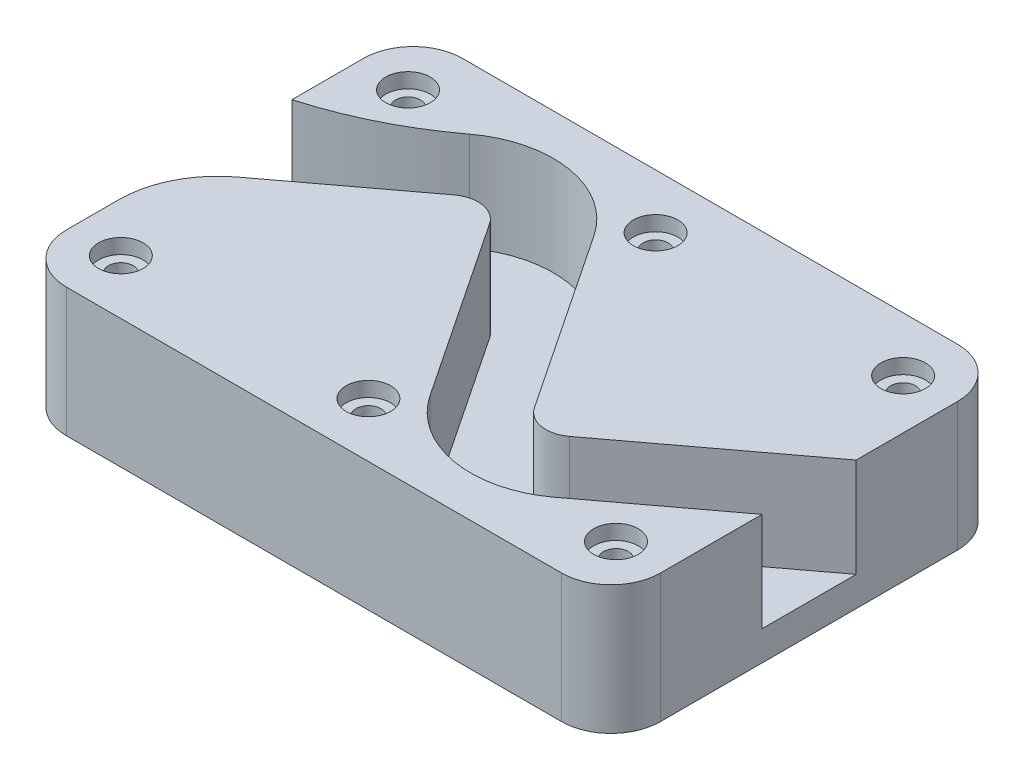
ISO-10303-21;
HEADER;
FILE_DESCRIPTION(('STEP AP214'),'2;1');
FILE_NAME('part.step','',(''),(''),'','','');
FILE_SCHEMA(('AUTOMOTIVE_DESIGN { 1 0 10303 214 1 1 1 1 }'));
ENDSEC;
DATA;
#1=APPLICATION_CONTEXT('core data for automotive mechanical design processes');
#2=APPLICATION_PROTOCOL_DEFINITION('international standard','automotive_design',2000,#1);
#3=PRODUCT_CONTEXT('',#1,'mechanical');
#4=PRODUCT('Part','Part','',(#3));
#5=PRODUCT_RELATED_PRODUCT_CATEGORY('part','',(#4));
#6=PRODUCT_DEFINITION_FORMATION('','',#4);
#7=PRODUCT_DEFINITION_CONTEXT('part definition',#1,'design');
#8=PRODUCT_DEFINITION('design','',#6,#7);
#9=PRODUCT_DEFINITION_SHAPE('','',#8);
#10=(LENGTH_UNIT() NAMED_UNIT(*) SI_UNIT(.MILLI.,.METRE.));
#11=(NAMED_UNIT(*) PLANE_ANGLE_UNIT() SI_UNIT($,.RADIAN.));
#12=(NAMED_UNIT(*) SI_UNIT($,.STERADIAN.) SOLID_ANGLE_UNIT());
#13=UNCERTAINTY_MEASURE_WITH_UNIT(LENGTH_MEASURE(1.E-05),#10,'distance_accuracy_value','');
#14=(GEOMETRIC_REPRESENTATION_CONTEXT(3) GLOBAL_UNCERTAINTY_ASSIGNED_CONTEXT((#13)) GLOBAL_UNIT_ASSIGNED_CONTEXT((#10,
#11,#12)) REPRESENTATION_CONTEXT('',''));
#15=CARTESIAN_POINT('',(0.,0.,0.));
#16=DIRECTION('',(0.,0.,1.));
#17=DIRECTION('',(1.,0.,0.));
#18=AXIS2_PLACEMENT_3D('',#15,#16,#17);
#19=CARTESIAN_POINT('',(-63.5,0.,36.83));
#20=DIRECTION('',(0.,1.,0.));
#21=DIRECTION('',(0.,0.,1.));
#22=AXIS2_PLACEMENT_3D('',#19,#20,#21);
#23=CYLINDRICAL_SURFACE('',#22,3.175);
#24=CARTESIAN_POINT('',(-63.5,0.,36.83));
#25=DIRECTION('',(0.,1.,0.));
#26=DIRECTION('',(0.,0.,1.));
#27=AXIS2_PLACEMENT_3D('',#24,#25,#26);
#28=CIRCLE('',#27,3.175);
#29=CARTESIAN_POINT('',(-63.5,0.,40.005));
#30=VERTEX_POINT('',#29);
#31=EDGE_CURVE('E182',#30,#30,#28,.T.);
#32=ORIENTED_EDGE('',*,*,#31,.F.);
#33=EDGE_LOOP('',(#32));
#34=FACE_BOUND('',#33,.T.);
#35=CARTESIAN_POINT('',(-63.5,29.21,36.83));
#36=DIRECTION('',(0.,1.,0.));
#37=DIRECTION('',(0.,0.,1.));
#38=AXIS2_PLACEMENT_3D('',#35,#36,#37);
#39=CIRCLE('',#38,3.175);
#40=CARTESIAN_POINT('',(-63.5,29.21,40.005));
#41=VERTEX_POINT('',#40);
#42=EDGE_CURVE('E39',#41,#41,#39,.F.);
#43=ORIENTED_EDGE('',*,*,#42,.F.);
#44=EDGE_LOOP('',(#43));
#45=FACE_BOUND('',#44,.T.);
#46=ADVANCED_FACE('F35',(#34,#45),#23,.F.);
#47=CARTESIAN_POINT('',(3.33066907387547E-13,0.,36.83));
#48=DIRECTION('',(0.,1.,0.));
#49=DIRECTION('',(0.,0.,1.));
#50=AXIS2_PLACEMENT_3D('',#47,#48,#49);
#51=CYLINDRICAL_SURFACE('',#50,3.175);
#52=CARTESIAN_POINT('',(3.33066907387547E-13,0.,36.83));
#53=DIRECTION('',(0.,1.,0.));
#54=DIRECTION('',(0.,0.,1.));
#55=AXIS2_PLACEMENT_3D('',#52,#53,#54);
#56=CIRCLE('',#55,3.175);
#57=CARTESIAN_POINT('',(3.33066907387547E-13,0.,40.005));
#58=VERTEX_POINT('',#57);
#59=EDGE_CURVE('E233',#58,#58,#56,.T.);
#60=ORIENTED_EDGE('',*,*,#59,.F.);
#61=EDGE_LOOP('',(#60));
#62=FACE_BOUND('',#61,.T.);
#63=CARTESIAN_POINT('',(3.33066907387547E-13,29.21,36.83));
#64=DIRECTION('',(0.,1.,0.));
#65=DIRECTION('',(0.,0.,1.));
#66=AXIS2_PLACEMENT_3D('',#63,#64,#65);
#67=CIRCLE('',#66,3.175);
#68=CARTESIAN_POINT('',(3.33066907387547E-13,29.21,40.005));
#69=VERTEX_POINT('',#68);
#70=EDGE_CURVE('E198',#69,#69,#67,.F.);
#71=ORIENTED_EDGE('',*,*,#70,.F.);
#72=EDGE_LOOP('',(#71));
#73=FACE_BOUND('',#72,.T.);
#74=ADVANCED_FACE('F496',(#62,#73),#51,.F.);
#75=CARTESIAN_POINT('',(63.5,0.,36.83));
#76=DIRECTION('',(0.,1.,0.));
#77=DIRECTION('',(0.,0.,1.));
#78=AXIS2_PLACEMENT_3D('',#75,#76,#77);
#79=CYLINDRICAL_SURFACE('',#78,3.175);
#80=CARTESIAN_POINT('',(63.5,0.,36.83));
#81=DIRECTION('',(0.,1.,0.));
#82=DIRECTION('',(0.,0.,1.));
#83=AXIS2_PLACEMENT_3D('',#80,#81,#82);
#84=CIRCLE('',#83,3.175);
#85=CARTESIAN_POINT('',(63.5,0.,40.005));
#86=VERTEX_POINT('',#85);
#87=EDGE_CURVE('E236',#86,#86,#84,.T.);
#88=ORIENTED_EDGE('',*,*,#87,.F.);
#89=EDGE_LOOP('',(#88));
#90=FACE_BOUND('',#89,.T.);
#91=CARTESIAN_POINT('',(63.5,29.21,36.83));
#92=DIRECTION('',(0.,1.,0.));
#93=DIRECTION('',(0.,0.,1.));
#94=AXIS2_PLACEMENT_3D('',#91,#92,#93);
#95=CIRCLE('',#94,3.175);
#96=CARTESIAN_POINT('',(63.5,29.21,40.005));
#97=VERTEX_POINT('',#96);
#98=EDGE_CURVE('E194',#97,#97,#95,.F.);
#99=ORIENTED_EDGE('',*,*,#98,.F.);
#100=EDGE_LOOP('',(#99));
#101=FACE_BOUND('',#100,.T.);
#102=ADVANCED_FACE('F502',(#90,#101),#79,.F.);
#103=CARTESIAN_POINT('',(63.5,0.,-36.83));
#104=DIRECTION('',(0.,1.,0.));
#105=DIRECTION('',(0.,0.,1.));
#106=AXIS2_PLACEMENT_3D('',#103,#104,#105);
#107=CYLINDRICAL_SURFACE('',#106,3.175);
#108=CARTESIAN_POINT('',(63.5,0.,-36.83));
#109=DIRECTION('',(0.,1.,0.));
#110=DIRECTION('',(0.,0.,1.));
#111=AXIS2_PLACEMENT_3D('',#108,#109,#110);
#112=CIRCLE('',#111,3.175);
#113=CARTESIAN_POINT('',(63.5,0.,-33.655));
#114=VERTEX_POINT('',#113);
#115=EDGE_CURVE('E245',#114,#114,#112,.T.);
#116=ORIENTED_EDGE('',*,*,#115,.F.);
#117=EDGE_LOOP('',(#116));
#118=FACE_BOUND('',#117,.T.);
#119=CARTESIAN_POINT('',(63.5,29.21,-36.83));
#120=DIRECTION('',(0.,1.,0.));
#121=DIRECTION('',(0.,0.,1.));
#122=AXIS2_PLACEMENT_3D('',#119,#120,#121);
#123=CIRCLE('',#122,3.175);
#124=CARTESIAN_POINT('',(63.5,29.21,-33.655));
#125=VERTEX_POINT('',#124);
#126=EDGE_CURVE('E189',#125,#125,#123,.F.);
#127=ORIENTED_EDGE('',*,*,#126,.F.);
#128=EDGE_LOOP('',(#127));
#129=FACE_BOUND('',#128,.T.);
#130=ADVANCED_FACE('F513',(#118,#129),#107,.F.);
#131=CARTESIAN_POINT('',(0.,0.,-36.83));
#132=DIRECTION('',(0.,1.,0.));
#133=DIRECTION('',(0.,0.,1.));
#134=AXIS2_PLACEMENT_3D('',#131,#132,#133);
#135=CYLINDRICAL_SURFACE('',#134,3.175);
#136=CARTESIAN_POINT('',(0.,0.,-36.83));
#137=DIRECTION('',(0.,1.,0.));
#138=DIRECTION('',(0.,0.,1.));
#139=AXIS2_PLACEMENT_3D('',#136,#137,#138);
#140=CIRCLE('',#139,3.175);
#141=CARTESIAN_POINT('',(0.,0.,-33.655));
#142=VERTEX_POINT('',#141);
#143=EDGE_CURVE('E242',#142,#142,#140,.T.);
#144=ORIENTED_EDGE('',*,*,#143,.F.);
#145=EDGE_LOOP('',(#144));
#146=FACE_BOUND('',#145,.T.);
#147=CARTESIAN_POINT('',(0.,29.21,-36.83));
#148=DIRECTION('',(0.,1.,0.));
#149=DIRECTION('',(0.,0.,1.));
#150=AXIS2_PLACEMENT_3D('',#147,#148,#149);
#151=CIRCLE('',#150,3.175);
#152=CARTESIAN_POINT('',(0.,29.21,-33.655));
#153=VERTEX_POINT('',#152);
#154=EDGE_CURVE('E184',#153,#153,#151,.F.);
#155=ORIENTED_EDGE('',*,*,#154,.F.);
#156=EDGE_LOOP('',(#155));
#157=FACE_BOUND('',#156,.T.);
#158=ADVANCED_FACE('F518',(#146,#157),#135,.F.);
#159=CARTESIAN_POINT('',(-63.5,0.,-36.83));
#160=DIRECTION('',(0.,1.,0.));
#161=DIRECTION('',(0.,0.,1.));
#162=AXIS2_PLACEMENT_3D('',#159,#160,#161);
#163=CYLINDRICAL_SURFACE('',#162,3.175);
#164=CARTESIAN_POINT('',(-63.5,0.,-36.83));
#165=DIRECTION('',(0.,1.,0.));
#166=DIRECTION('',(0.,0.,1.));
#167=AXIS2_PLACEMENT_3D('',#164,#165,#166);
#168=CIRCLE('',#167,3.175);
#169=CARTESIAN_POINT('',(-63.5,0.,-33.655));
#170=VERTEX_POINT('',#169);
#171=EDGE_CURVE('E239',#170,#170,#168,.T.);
#172=ORIENTED_EDGE('',*,*,#171,.F.);
#173=EDGE_LOOP('',(#172));
#174=FACE_BOUND('',#173,.T.);
#175=CARTESIAN_POINT('',(-63.5,29.21,-36.83));
#176=DIRECTION('',(0.,1.,0.));
#177=DIRECTION('',(0.,0.,1.));
#178=AXIS2_PLACEMENT_3D('',#175,#176,#177);
#179=CIRCLE('',#178,3.175);
#180=CARTESIAN_POINT('',(-63.5,29.21,-33.655));
#181=VERTEX_POINT('',#180);
#182=EDGE_CURVE('E179',#181,#181,#179,.F.);
#183=ORIENTED_EDGE('',*,*,#182,.F.);
#184=EDGE_LOOP('',(#183));
#185=FACE_BOUND('',#184,.T.);
#186=ADVANCED_FACE('F515',(#174,#185),#163,.F.);
#187=CARTESIAN_POINT('',(-63.5,33.02,-38.1));
#188=DIRECTION('',(0.,1.,0.));
#189=DIRECTION('',(0.,0.,1.));
#190=AXIS2_PLACEMENT_3D('',#187,#188,#189);
#191=PLANE('',#190);
#192=CARTESIAN_POINT('',(-63.5,33.02,36.83));
#193=DIRECTION('',(0.,1.,0.));
#194=DIRECTION('',(0.,0.,1.));
#195=AXIS2_PLACEMENT_3D('',#192,#193,#194);
#196=CIRCLE('',#195,5.715);
#197=CARTESIAN_POINT('',(-63.5,33.02,42.545));
#198=VERTEX_POINT('',#197);
#199=EDGE_CURVE('E214',#198,#198,#196,.T.);
#200=ORIENTED_EDGE('',*,*,#199,.F.);
#201=EDGE_LOOP('',(#200));
#202=FACE_BOUND('',#201,.T.);
#203=CARTESIAN_POINT('',(3.33066907387547E-13,33.02,36.83));
#204=DIRECTION('',(0.,1.,0.));
#205=DIRECTION('',(0.,0.,1.));
#206=AXIS2_PLACEMENT_3D('',#203,#204,#205);
#207=CIRCLE('',#206,5.715);
#208=CARTESIAN_POINT('',(3.33066907387547E-13,33.02,42.545));
#209=VERTEX_POINT('',#208);
#210=EDGE_CURVE('E207',#209,#209,#207,.T.);
#211=ORIENTED_EDGE('',*,*,#210,.F.);
#212=EDGE_LOOP('',(#211));
#213=FACE_BOUND('',#212,.T.);
#214=CARTESIAN_POINT('',(63.5,33.02,36.83));
#215=DIRECTION('',(0.,1.,0.));
#216=DIRECTION('',(0.,0.,1.));
#217=AXIS2_PLACEMENT_3D('',#214,#215,#216);
#218=CIRCLE('',#217,5.71499999999999);
#219=CARTESIAN_POINT('',(63.5,33.02,42.545));
#220=VERTEX_POINT('',#219);
#221=EDGE_CURVE('E200',#220,#220,#218,.T.);
#222=ORIENTED_EDGE('',*,*,#221,.F.);
#223=EDGE_LOOP('',(#222));
#224=FACE_BOUND('',#223,.T.);
#225=DIRECTION('',(0.8,0.,-0.6));
#226=VECTOR('',#225,1.);
#227=CARTESIAN_POINT('',(45.7977514732922,33.02,34.8666863950309));
#228=LINE('',#227,#226);
#229=CARTESIAN_POINT('',(45.7977514732922,33.02,34.8666863950309));
#230=VERTEX_POINT('',#229);
#231=CARTESIAN_POINT('',(76.2,33.02,12.065));
#232=VERTEX_POINT('',#231);
#233=EDGE_CURVE('E252',#230,#232,#228,.T.);
#234=ORIENTED_EDGE('',*,*,#233,.F.);
#235=CARTESIAN_POINT('',(29.643351473292,33.02,13.327486395031));
#236=DIRECTION('',(0.,1.,0.));
#237=DIRECTION('',(0.,0.,-1.));
#238=AXIS2_PLACEMENT_3D('',#235,#236,#237);
#239=CIRCLE('',#238,26.924);
#240=CARTESIAN_POINT('',(7.24122934853979,33.02,28.2622344781989));
#241=VERTEX_POINT('',#240);
#242=EDGE_CURVE('E313',#241,#230,#239,.T.);
#243=ORIENTED_EDGE('',*,*,#242,.F.);
#244=DIRECTION('',(0.554700196225229,0.,0.832050294337843));
#245=VECTOR('',#244,1.);
#246=CARTESIAN_POINT('',(-23.3031282304376,33.02,-17.5543018902672));
#247=LINE('',#246,#245);
#248=CARTESIAN_POINT('',(-23.3031282304376,33.02,-17.5543018902672));
#249=VERTEX_POINT('',#248);
#250=EDGE_CURVE('E310',#249,#241,#247,.T.);
#251=ORIENTED_EDGE('',*,*,#250,.F.);
#252=CARTESIAN_POINT('',(-29.643351473292,33.02,-13.327486395031));
#253=DIRECTION('',(0.,-1.,0.));
#254=DIRECTION('',(0.,0.,-1.));
#255=AXIS2_PLACEMENT_3D('',#252,#253,#254);
#256=CIRCLE('',#255,7.62);
#257=CARTESIAN_POINT('',(-34.2153514732921,33.02,-19.423486395031));
#258=VERTEX_POINT('',#257);
#259=EDGE_CURVE('E307',#258,#249,#256,.T.);
#260=ORIENTED_EDGE('',*,*,#259,.F.);
#261=DIRECTION('',(0.8,0.,-0.6));
#262=VECTOR('',#261,1.);
#263=CARTESIAN_POINT('',(-66.04,33.02,4.44500000000001));
#264=LINE('',#263,#262);
#265=CARTESIAN_POINT('',(-66.04,33.02,4.44500000000001));
#266=VERTEX_POINT('',#265);
#267=EDGE_CURVE('E304',#266,#258,#264,.T.);
#268=ORIENTED_EDGE('',*,*,#267,.F.);
#269=CARTESIAN_POINT('',(-50.8,33.02,24.765));
#270=DIRECTION('',(0.,-1.,0.));
#271=DIRECTION('',(0.,0.,-1.));
#272=AXIS2_PLACEMENT_3D('',#269,#270,#271);
#273=CIRCLE('',#272,25.4);
#274=CARTESIAN_POINT('',(-76.2,33.02,24.765));
#275=VERTEX_POINT('',#274);
#276=EDGE_CURVE('E301',#275,#266,#273,.T.);
#277=ORIENTED_EDGE('',*,*,#276,.F.);
#278=DIRECTION('',(0.,0.,1.));
#279=VECTOR('',#278,1.);
#280=CARTESIAN_POINT('',(-76.2,33.02,38.0999999999999));
#281=LINE('',#280,#279);
#282=CARTESIAN_POINT('',(-76.2,33.02,38.0999999999999));
#283=VERTEX_POINT('',#282);
#284=EDGE_CURVE('E354',#275,#283,#281,.T.);
#285=ORIENTED_EDGE('',*,*,#284,.T.);
#286=CARTESIAN_POINT('',(-63.5,33.02,38.1));
#287=DIRECTION('',(0.,1.,0.));
#288=DIRECTION('',(0.,0.,-1.));
#289=AXIS2_PLACEMENT_3D('',#286,#287,#288);
#290=CIRCLE('',#289,12.7);
#291=CARTESIAN_POINT('',(-63.4999999999999,33.02,50.8));
#292=VERTEX_POINT('',#291);
#293=EDGE_CURVE('E356',#283,#292,#290,.T.);
#294=ORIENTED_EDGE('',*,*,#293,.T.);
#295=DIRECTION('',(1.,0.,0.));
#296=VECTOR('',#295,1.);
#297=CARTESIAN_POINT('',(-63.4999999999999,33.02,50.8));
#298=LINE('',#297,#296);
#299=CARTESIAN_POINT('',(63.4999999999999,33.02,50.8));
#300=VERTEX_POINT('',#299);
#301=EDGE_CURVE('E358',#292,#300,#298,.T.);
#302=ORIENTED_EDGE('',*,*,#301,.T.);
#303=CARTESIAN_POINT('',(63.5,33.02,38.1));
#304=DIRECTION('',(0.,1.,0.));
#305=DIRECTION('',(0.,0.,-1.));
#306=AXIS2_PLACEMENT_3D('',#303,#304,#305);
#307=CIRCLE('',#306,12.7);
#308=CARTESIAN_POINT('',(76.2,33.02,38.0999999999999));
#309=VERTEX_POINT('',#308);
#310=EDGE_CURVE('E130',#300,#309,#307,.T.);
#311=ORIENTED_EDGE('',*,*,#310,.T.);
#312=DIRECTION('',(0.,0.,-1.));
#313=VECTOR('',#312,1.);
#314=CARTESIAN_POINT('',(76.2,33.02,38.0999999999999));
#315=LINE('',#314,#313);
#316=EDGE_CURVE('E129',#309,#232,#315,.T.);
#317=ORIENTED_EDGE('',*,*,#316,.T.);
#318=EDGE_LOOP('',(#234,#243,#251,#260,#268,#277,#285,#294,#302,#311,#317));
#319=FACE_BOUND('',#318,.T.);
#320=ADVANCED_FACE('F363',(#202,#213,#224,#319),#191,.T.);
#321=CARTESIAN_POINT('',(-63.5,33.02,-38.1));
#322=DIRECTION('',(0.,-1.,0.));
#323=DIRECTION('',(0.,0.,-1.));
#324=AXIS2_PLACEMENT_3D('',#321,#322,#323);
#325=CYLINDRICAL_SURFACE('',#324,12.7);
#326=CARTESIAN_POINT('',(-63.5,0.,-38.1));
#327=DIRECTION('',(0.,1.,0.));
#328=DIRECTION('',(0.,0.,1.));
#329=AXIS2_PLACEMENT_3D('',#326,#327,#328);
#330=CIRCLE('',#329,12.7);
#331=CARTESIAN_POINT('',(-63.4999999999999,0.,-50.8));
#332=VERTEX_POINT('',#331);
#333=CARTESIAN_POINT('',(-76.2,0.,-38.0999999999999));
#334=VERTEX_POINT('',#333);
#335=EDGE_CURVE('E151',#332,#334,#330,.T.);
#336=ORIENTED_EDGE('',*,*,#335,.T.);
#337=DIRECTION('',(0.,-1.,0.));
#338=VECTOR('',#337,1.);
#339=CARTESIAN_POINT('',(-76.2,33.02,-38.0999999999999));
#340=LINE('',#339,#338);
#341=CARTESIAN_POINT('',(-76.2,33.02,-38.0999999999999));
#342=VERTEX_POINT('',#341);
#343=EDGE_CURVE('E11',#342,#334,#340,.T.);
#344=ORIENTED_EDGE('',*,*,#343,.F.);
#345=CARTESIAN_POINT('',(-63.5,33.02,-38.1));
#346=DIRECTION('',(0.,1.,0.));
#347=DIRECTION('',(0.,0.,1.));
#348=AXIS2_PLACEMENT_3D('',#345,#346,#347);
#349=CIRCLE('',#348,12.7);
#350=CARTESIAN_POINT('',(-63.4999999999999,33.02,-50.8));
#351=VERTEX_POINT('',#350);
#352=EDGE_CURVE('E167',#351,#342,#349,.T.);
#353=ORIENTED_EDGE('',*,*,#352,.F.);
#354=DIRECTION('',(0.,-1.,0.));
#355=VECTOR('',#354,1.);
#356=CARTESIAN_POINT('',(-63.4999999999999,33.02,-50.8));
#357=LINE('',#356,#355);
#358=EDGE_CURVE('E146',#351,#332,#357,.T.);
#359=ORIENTED_EDGE('',*,*,#358,.T.);
#360=EDGE_LOOP('',(#336,#344,#353,#359));
#361=FACE_BOUND('',#360,.T.);
#362=ADVANCED_FACE('F37',(#361),#325,.T.);
#363=CARTESIAN_POINT('',(-76.2,33.02,38.0999999999999));
#364=DIRECTION('',(1.,0.,0.));
#365=DIRECTION('',(0.,0.,-1.));
#366=AXIS2_PLACEMENT_3D('',#363,#364,#365);
#367=PLANE('',#366);
#368=ORIENTED_EDGE('',*,*,#284,.F.);
#369=DIRECTION('',(0.,1.,0.));
#370=VECTOR('',#369,1.);
#371=CARTESIAN_POINT('',(-76.2,7.62,24.765));
#372=LINE('',#371,#370);
#373=CARTESIAN_POINT('',(-76.2,7.62,24.765));
#374=VERTEX_POINT('',#373);
#375=EDGE_CURVE('E335',#374,#275,#372,.T.);
#376=ORIENTED_EDGE('',*,*,#375,.F.);
#377=DIRECTION('',(0.,0.,1.));
#378=VECTOR('',#377,1.);
#379=CARTESIAN_POINT('',(-76.2,7.62,-19.7593275655722));
#380=LINE('',#379,#378);
#381=CARTESIAN_POINT('',(-76.2,7.62,-19.7593275655722));
#382=VERTEX_POINT('',#381);
#383=EDGE_CURVE('E267',#382,#374,#380,.T.);
#384=ORIENTED_EDGE('',*,*,#383,.F.);
#385=DIRECTION('',(0.,1.,0.));
#386=VECTOR('',#385,1.);
#387=CARTESIAN_POINT('',(-76.2,7.62,-19.7593275655722));
#388=LINE('',#387,#386);
#389=CARTESIAN_POINT('',(-76.2,33.02,-19.7593275655722));
#390=VERTEX_POINT('',#389);
#391=EDGE_CURVE('E338',#382,#390,#388,.T.);
#392=ORIENTED_EDGE('',*,*,#391,.T.);
#393=EDGE_CURVE('E102',#342,#390,#281,.T.);
#394=ORIENTED_EDGE('',*,*,#393,.F.);
#395=ORIENTED_EDGE('',*,*,#343,.T.);
#396=DIRECTION('',(0.,0.,1.));
#397=VECTOR('',#396,1.);
#398=CARTESIAN_POINT('',(-76.2,0.,38.0999999999999));
#399=LINE('',#398,#397);
#400=CARTESIAN_POINT('',(-76.2,0.,38.0999999999999));
#401=VERTEX_POINT('',#400);
#402=EDGE_CURVE('E154',#334,#401,#399,.T.);
#403=ORIENTED_EDGE('',*,*,#402,.T.);
#404=DIRECTION('',(0.,-1.,0.));
#405=VECTOR('',#404,1.);
#406=CARTESIAN_POINT('',(-76.2,33.02,38.0999999999999));
#407=LINE('',#406,#405);
#408=EDGE_CURVE('E44',#283,#401,#407,.T.);
#409=ORIENTED_EDGE('',*,*,#408,.F.);
#410=EDGE_LOOP('',(#368,#376,#384,#392,#394,#395,#403,#409));
#411=FACE_BOUND('',#410,.T.);
#412=ADVANCED_FACE('F433',(#411),#367,.F.);
#413=CARTESIAN_POINT('',(-63.5,33.02,38.1));
#414=DIRECTION('',(0.,-1.,0.));
#415=DIRECTION('',(0.,0.,-1.));
#416=AXIS2_PLACEMENT_3D('',#413,#414,#415);
#417=CYLINDRICAL_SURFACE('',#416,12.7);
#418=CARTESIAN_POINT('',(-63.5,0.,38.1));
#419=DIRECTION('',(0.,1.,0.));
#420=DIRECTION('',(0.,0.,-1.));
#421=AXIS2_PLACEMENT_3D('',#418,#419,#420);
#422=CIRCLE('',#421,12.7);
#423=CARTESIAN_POINT('',(-63.4999999999999,0.,50.8));
#424=VERTEX_POINT('',#423);
#425=EDGE_CURVE('E157',#401,#424,#422,.T.);
#426=ORIENTED_EDGE('',*,*,#425,.T.);
#427=DIRECTION('',(0.,-1.,0.));
#428=VECTOR('',#427,1.);
#429=CARTESIAN_POINT('',(-63.4999999999999,33.02,50.8));
#430=LINE('',#429,#428);
#431=EDGE_CURVE('E174',#292,#424,#430,.T.);
#432=ORIENTED_EDGE('',*,*,#431,.F.);
#433=ORIENTED_EDGE('',*,*,#293,.F.);
#434=ORIENTED_EDGE('',*,*,#408,.T.);
#435=EDGE_LOOP('',(#426,#432,#433,#434));
#436=FACE_BOUND('',#435,.T.);
#437=ADVANCED_FACE('F440',(#436),#417,.T.);
#438=CARTESIAN_POINT('',(-63.4999999999999,33.02,50.8));
#439=DIRECTION('',(0.,0.,-1.));
#440=DIRECTION('',(-1.,0.,0.));
#441=AXIS2_PLACEMENT_3D('',#438,#439,#440);
#442=PLANE('',#441);
#443=DIRECTION('',(1.,0.,0.));
#444=VECTOR('',#443,1.);
#445=CARTESIAN_POINT('',(-63.4999999999999,0.,50.8));
#446=LINE('',#445,#444);
#447=CARTESIAN_POINT('',(63.4999999999999,0.,50.8));
#448=VERTEX_POINT('',#447);
#449=EDGE_CURVE('E159',#424,#448,#446,.T.);
#450=ORIENTED_EDGE('',*,*,#449,.T.);
#451=DIRECTION('',(0.,-1.,0.));
#452=VECTOR('',#451,1.);
#453=CARTESIAN_POINT('',(63.4999999999999,33.02,50.8));
#454=LINE('',#453,#452);
#455=EDGE_CURVE('E171',#300,#448,#454,.T.);
#456=ORIENTED_EDGE('',*,*,#455,.F.);
#457=ORIENTED_EDGE('',*,*,#301,.F.);
#458=ORIENTED_EDGE('',*,*,#431,.T.);
#459=EDGE_LOOP('',(#450,#456,#457,#458));
#460=FACE_BOUND('',#459,.T.);
#461=ADVANCED_FACE('F443',(#460),#442,.F.);
#462=CARTESIAN_POINT('',(63.5,33.02,38.1));
#463=DIRECTION('',(0.,-1.,0.));
#464=DIRECTION('',(0.,0.,-1.));
#465=AXIS2_PLACEMENT_3D('',#462,#463,#464);
#466=CYLINDRICAL_SURFACE('',#465,12.7);
#467=CARTESIAN_POINT('',(63.5,0.,38.1));
#468=DIRECTION('',(0.,1.,0.));
#469=DIRECTION('',(0.,0.,-1.));
#470=AXIS2_PLACEMENT_3D('',#467,#468,#469);
#471=CIRCLE('',#470,12.7);
#472=CARTESIAN_POINT('',(76.2,0.,38.0999999999999));
#473=VERTEX_POINT('',#472);
#474=EDGE_CURVE('E161',#448,#473,#471,.T.);
#475=ORIENTED_EDGE('',*,*,#474,.T.);
#476=DIRECTION('',(0.,-1.,0.));
#477=VECTOR('',#476,1.);
#478=CARTESIAN_POINT('',(76.2,33.02,38.0999999999999));
#479=LINE('',#478,#477);
#480=EDGE_CURVE('E141',#309,#473,#479,.T.);
#481=ORIENTED_EDGE('',*,*,#480,.F.);
#482=ORIENTED_EDGE('',*,*,#310,.F.);
#483=ORIENTED_EDGE('',*,*,#455,.T.);
#484=EDGE_LOOP('',(#475,#481,#482,#483));
#485=FACE_BOUND('',#484,.T.);
#486=ADVANCED_FACE('F368',(#485),#466,.T.);
#487=CARTESIAN_POINT('',(76.2,33.02,38.0999999999999));
#488=DIRECTION('',(-1.,0.,0.));
#489=DIRECTION('',(0.,0.,1.));
#490=AXIS2_PLACEMENT_3D('',#487,#488,#489);
#491=PLANE('',#490);
#492=DIRECTION('',(0.,0.,-1.));
#493=VECTOR('',#492,1.);
#494=CARTESIAN_POINT('',(76.2,7.62,-12.065));
#495=LINE('',#494,#493);
#496=CARTESIAN_POINT('',(76.2,7.62,12.065));
#497=VERTEX_POINT('',#496);
#498=CARTESIAN_POINT('',(76.2,7.62,-12.065));
#499=VERTEX_POINT('',#498);
#500=EDGE_CURVE('E248',#497,#499,#495,.T.);
#501=ORIENTED_EDGE('',*,*,#500,.F.);
#502=DIRECTION('',(0.,1.,0.));
#503=VECTOR('',#502,1.);
#504=CARTESIAN_POINT('',(76.2,7.62,12.065));
#505=LINE('',#504,#503);
#506=EDGE_CURVE('E155',#497,#232,#505,.T.);
#507=ORIENTED_EDGE('',*,*,#506,.T.);
#508=ORIENTED_EDGE('',*,*,#316,.F.);
#509=ORIENTED_EDGE('',*,*,#480,.T.);
#510=DIRECTION('',(0.,0.,-1.));
#511=VECTOR('',#510,1.);
#512=CARTESIAN_POINT('',(76.2,0.,38.0999999999999));
#513=LINE('',#512,#511);
#514=CARTESIAN_POINT('',(76.2,0.,-38.0999999999999));
#515=VERTEX_POINT('',#514);
#516=EDGE_CURVE('E138',#473,#515,#513,.T.);
#517=ORIENTED_EDGE('',*,*,#516,.T.);
#518=DIRECTION('',(0.,-1.,0.));
#519=VECTOR('',#518,1.);
#520=CARTESIAN_POINT('',(76.2,33.02,-38.0999999999999));
#521=LINE('',#520,#519);
#522=CARTESIAN_POINT('',(76.2,33.02,-38.0999999999999));
#523=VERTEX_POINT('',#522);
#524=EDGE_CURVE('E133',#523,#515,#521,.T.);
#525=ORIENTED_EDGE('',*,*,#524,.F.);
#526=CARTESIAN_POINT('',(76.2,33.02,-12.065));
#527=VERTEX_POINT('',#526);
#528=EDGE_CURVE('E119',#527,#523,#315,.T.);
#529=ORIENTED_EDGE('',*,*,#528,.F.);
#530=DIRECTION('',(0.,1.,0.));
#531=VECTOR('',#530,1.);
#532=CARTESIAN_POINT('',(76.2,7.62,-12.065));
#533=LINE('',#532,#531);
#534=EDGE_CURVE('E52',#499,#527,#533,.T.);
#535=ORIENTED_EDGE('',*,*,#534,.F.);
#536=EDGE_LOOP('',(#501,#507,#508,#509,#517,#525,#529,#535));
#537=FACE_BOUND('',#536,.T.);
#538=ADVANCED_FACE('F135',(#537),#491,.F.);
#539=CARTESIAN_POINT('',(63.5,33.02,-38.1));
#540=DIRECTION('',(0.,-1.,0.));
#541=DIRECTION('',(0.,0.,-1.));
#542=AXIS2_PLACEMENT_3D('',#539,#540,#541);
#543=CYLINDRICAL_SURFACE('',#542,12.7);
#544=CARTESIAN_POINT('',(63.5,0.,-38.1));
#545=DIRECTION('',(0.,1.,0.));
#546=DIRECTION('',(0.,0.,1.));
#547=AXIS2_PLACEMENT_3D('',#544,#545,#546);
#548=CIRCLE('',#547,12.7);
#549=CARTESIAN_POINT('',(63.4999999999999,0.,-50.8));
#550=VERTEX_POINT('',#549);
#551=EDGE_CURVE('E164',#515,#550,#548,.T.);
#552=ORIENTED_EDGE('',*,*,#551,.T.);
#553=DIRECTION('',(0.,-1.,0.));
#554=VECTOR('',#553,1.);
#555=CARTESIAN_POINT('',(63.4999999999999,33.02,-50.8));
#556=LINE('',#555,#554);
#557=CARTESIAN_POINT('',(63.4999999999999,33.02,-50.8));
#558=VERTEX_POINT('',#557);
#559=EDGE_CURVE('E142',#558,#550,#556,.T.);
#560=ORIENTED_EDGE('',*,*,#559,.F.);
#561=CARTESIAN_POINT('',(63.5,33.02,-38.1));
#562=DIRECTION('',(0.,1.,0.));
#563=DIRECTION('',(0.,0.,1.));
#564=AXIS2_PLACEMENT_3D('',#561,#562,#563);
#565=CIRCLE('',#564,12.7);
#566=EDGE_CURVE('E124',#523,#558,#565,.T.);
#567=ORIENTED_EDGE('',*,*,#566,.F.);
#568=ORIENTED_EDGE('',*,*,#524,.T.);
#569=EDGE_LOOP('',(#552,#560,#567,#568));
#570=FACE_BOUND('',#569,.T.);
#571=ADVANCED_FACE('F144',(#570),#543,.T.);
#572=CARTESIAN_POINT('',(-63.4999999999999,33.02,-50.8));
#573=DIRECTION('',(0.,0.,1.));
#574=DIRECTION('',(1.,0.,0.));
#575=AXIS2_PLACEMENT_3D('',#572,#573,#574);
#576=PLANE('',#575);
#577=DIRECTION('',(-1.,0.,0.));
#578=VECTOR('',#577,1.);
#579=CARTESIAN_POINT('',(-63.4999999999999,0.,-50.8));
#580=LINE('',#579,#578);
#581=EDGE_CURVE('E94',#550,#332,#580,.T.);
#582=ORIENTED_EDGE('',*,*,#581,.T.);
#583=ORIENTED_EDGE('',*,*,#358,.F.);
#584=DIRECTION('',(-1.,0.,0.));
#585=VECTOR('',#584,1.);
#586=CARTESIAN_POINT('',(-63.4999999999999,33.02,-50.8));
#587=LINE('',#586,#585);
#588=EDGE_CURVE('E61',#558,#351,#587,.T.);
#589=ORIENTED_EDGE('',*,*,#588,.F.);
#590=ORIENTED_EDGE('',*,*,#559,.T.);
#591=EDGE_LOOP('',(#582,#583,#589,#590));
#592=FACE_BOUND('',#591,.T.);
#593=ADVANCED_FACE('F447',(#592),#576,.F.);
#594=CARTESIAN_POINT('',(63.5,33.02,-36.83));
#595=DIRECTION('',(0.,1.,0.));
#596=DIRECTION('',(0.,0.,1.));
#597=AXIS2_PLACEMENT_3D('',#594,#595,#596);
#598=CIRCLE('',#597,5.71499999999999);
#599=CARTESIAN_POINT('',(63.5,33.02,-31.115));
#600=VERTEX_POINT('',#599);
#601=EDGE_CURVE('E196',#600,#600,#598,.T.);
#602=ORIENTED_EDGE('',*,*,#601,.F.);
#603=EDGE_LOOP('',(#602));
#604=FACE_BOUND('',#603,.T.);
#605=CARTESIAN_POINT('',(0.,33.02,-36.83));
#606=DIRECTION('',(0.,1.,0.));
#607=DIRECTION('',(0.,0.,1.));
#608=AXIS2_PLACEMENT_3D('',#605,#606,#607);
#609=CIRCLE('',#608,5.715);
#610=CARTESIAN_POINT('',(0.,33.02,-31.115));
#611=VERTEX_POINT('',#610);
#612=EDGE_CURVE('E192',#611,#611,#609,.T.);
#613=ORIENTED_EDGE('',*,*,#612,.F.);
#614=EDGE_LOOP('',(#613));
#615=FACE_BOUND('',#614,.T.);
#616=CARTESIAN_POINT('',(-63.5,33.02,-36.83));
#617=DIRECTION('',(0.,1.,0.));
#618=DIRECTION('',(0.,0.,1.));
#619=AXIS2_PLACEMENT_3D('',#616,#617,#618);
#620=CIRCLE('',#619,5.715);
#621=CARTESIAN_POINT('',(-63.5,33.02,-31.115));
#622=VERTEX_POINT('',#621);
#623=EDGE_CURVE('E187',#622,#622,#620,.T.);
#624=ORIENTED_EDGE('',*,*,#623,.F.);
#625=EDGE_LOOP('',(#624));
#626=FACE_BOUND('',#625,.T.);
#627=CARTESIAN_POINT('',(-101.968790940015,33.02,-109.761405683995));
#628=DIRECTION('',(0.,-1.,0.));
#629=DIRECTION('',(0.,0.,-1.));
#630=AXIS2_PLACEMENT_3D('',#627,#628,#629);
#631=CIRCLE('',#630,93.6183991112056);
#632=CARTESIAN_POINT('',(-45.7977514732922,33.02,-34.8666863950308));
#633=VERTEX_POINT('',#632);
#634=EDGE_CURVE('E298',#633,#390,#631,.T.);
#635=ORIENTED_EDGE('',*,*,#634,.F.);
#636=CARTESIAN_POINT('',(-29.643351473292,33.02,-13.327486395031));
#637=DIRECTION('',(0.,1.,0.));
#638=DIRECTION('',(0.,0.,-1.));
#639=AXIS2_PLACEMENT_3D('',#636,#637,#638);
#640=CIRCLE('',#639,26.924);
#641=CARTESIAN_POINT('',(-7.2412293485398,33.02,-28.2622344781989));
#642=VERTEX_POINT('',#641);
#643=EDGE_CURVE('E295',#642,#633,#640,.T.);
#644=ORIENTED_EDGE('',*,*,#643,.F.);
#645=DIRECTION('',(-0.554700196225229,0.,-0.832050294337843));
#646=VECTOR('',#645,1.);
#647=CARTESIAN_POINT('',(-7.2412293485398,33.02,-28.2622344781989));
#648=LINE('',#647,#646);
#649=CARTESIAN_POINT('',(23.3031282304376,33.02,17.5543018902672));
#650=VERTEX_POINT('',#649);
#651=EDGE_CURVE('E292',#650,#642,#648,.T.);
#652=ORIENTED_EDGE('',*,*,#651,.F.);
#653=CARTESIAN_POINT('',(29.643351473292,33.02,13.327486395031));
#654=DIRECTION('',(0.,-1.,0.));
#655=DIRECTION('',(0.,0.,-1.));
#656=AXIS2_PLACEMENT_3D('',#653,#654,#655);
#657=CIRCLE('',#656,7.62);
#658=CARTESIAN_POINT('',(34.2153514732921,33.02,19.423486395031));
#659=VERTEX_POINT('',#658);
#660=EDGE_CURVE('E289',#659,#650,#657,.T.);
#661=ORIENTED_EDGE('',*,*,#660,.F.);
#662=DIRECTION('',(-0.8,0.,0.6));
#663=VECTOR('',#662,1.);
#664=CARTESIAN_POINT('',(34.2153514732921,33.02,19.423486395031));
#665=LINE('',#664,#663);
#666=EDGE_CURVE('E127',#527,#659,#665,.T.);
#667=ORIENTED_EDGE('',*,*,#666,.F.);
#668=ORIENTED_EDGE('',*,*,#528,.T.);
#669=ORIENTED_EDGE('',*,*,#566,.T.);
#670=ORIENTED_EDGE('',*,*,#588,.T.);
#671=ORIENTED_EDGE('',*,*,#352,.T.);
#672=ORIENTED_EDGE('',*,*,#393,.T.);
#673=EDGE_LOOP('',(#635,#644,#652,#661,#667,#668,#669,#670,#671,#672));
#674=FACE_BOUND('',#673,.T.);
#675=ADVANCED_FACE('F122',(#604,#615,#626,#674),#191,.T.);
#676=CARTESIAN_POINT('',(-63.5,0.,-38.1));
#677=DIRECTION('',(0.,1.,0.));
#678=DIRECTION('',(0.,0.,1.));
#679=AXIS2_PLACEMENT_3D('',#676,#677,#678);
#680=PLANE('',#679);
#681=ORIENTED_EDGE('',*,*,#31,.T.);
#682=EDGE_LOOP('',(#681));
#683=FACE_BOUND('',#682,.T.);
#684=ORIENTED_EDGE('',*,*,#59,.T.);
#685=EDGE_LOOP('',(#684));
#686=FACE_BOUND('',#685,.T.);
#687=ORIENTED_EDGE('',*,*,#87,.T.);
#688=EDGE_LOOP('',(#687));
#689=FACE_BOUND('',#688,.T.);
#690=ORIENTED_EDGE('',*,*,#171,.T.);
#691=EDGE_LOOP('',(#690));
#692=FACE_BOUND('',#691,.T.);
#693=ORIENTED_EDGE('',*,*,#143,.T.);
#694=EDGE_LOOP('',(#693));
#695=FACE_BOUND('',#694,.T.);
#696=ORIENTED_EDGE('',*,*,#115,.T.);
#697=EDGE_LOOP('',(#696));
#698=FACE_BOUND('',#697,.T.);
#699=ORIENTED_EDGE('',*,*,#335,.F.);
#700=ORIENTED_EDGE('',*,*,#581,.F.);
#701=ORIENTED_EDGE('',*,*,#551,.F.);
#702=ORIENTED_EDGE('',*,*,#516,.F.);
#703=ORIENTED_EDGE('',*,*,#474,.F.);
#704=ORIENTED_EDGE('',*,*,#449,.F.);
#705=ORIENTED_EDGE('',*,*,#425,.F.);
#706=ORIENTED_EDGE('',*,*,#402,.F.);
#707=EDGE_LOOP('',(#699,#700,#701,#702,#703,#704,#705,#706));
#708=FACE_BOUND('',#707,.T.);
#709=ADVANCED_FACE('F446',(#683,#686,#689,#692,#695,#698,#708),#680,.F.);
#710=CARTESIAN_POINT('',(45.7977514732922,7.62,34.8666863950309));
#711=DIRECTION('',(0.6,0.,0.8));
#712=DIRECTION('',(0.8,0.,-0.6));
#713=AXIS2_PLACEMENT_3D('',#710,#711,#712);
#714=PLANE('',#713);
#715=ORIENTED_EDGE('',*,*,#233,.T.);
#716=ORIENTED_EDGE('',*,*,#506,.F.);
#717=DIRECTION('',(0.8,0.,-0.6));
#718=VECTOR('',#717,1.);
#719=CARTESIAN_POINT('',(45.7977514732922,7.62,34.8666863950309));
#720=LINE('',#719,#718);
#721=CARTESIAN_POINT('',(45.7977514732922,7.62,34.8666863950309));
#722=VERTEX_POINT('',#721);
#723=EDGE_CURVE('E285',#722,#497,#720,.T.);
#724=ORIENTED_EDGE('',*,*,#723,.F.);
#725=DIRECTION('',(0.,1.,0.));
#726=VECTOR('',#725,1.);
#727=CARTESIAN_POINT('',(45.7977514732922,7.62,34.8666863950309));
#728=LINE('',#727,#726);
#729=EDGE_CURVE('E320',#722,#230,#728,.T.);
#730=ORIENTED_EDGE('',*,*,#729,.T.);
#731=EDGE_LOOP('',(#715,#716,#724,#730));
#732=FACE_BOUND('',#731,.T.);
#733=ADVANCED_FACE('F375',(#732),#714,.F.);
#734=CARTESIAN_POINT('',(29.643351473292,7.62,13.327486395031));
#735=DIRECTION('',(0.,1.,0.));
#736=DIRECTION('',(0.,0.,1.));
#737=AXIS2_PLACEMENT_3D('',#734,#735,#736);
#738=CYLINDRICAL_SURFACE('',#737,26.924);
#739=ORIENTED_EDGE('',*,*,#242,.T.);
#740=ORIENTED_EDGE('',*,*,#729,.F.);
#741=CARTESIAN_POINT('',(29.643351473292,7.62,13.327486395031));
#742=DIRECTION('',(0.,1.,0.));
#743=DIRECTION('',(0.,0.,-1.));
#744=AXIS2_PLACEMENT_3D('',#741,#742,#743);
#745=CIRCLE('',#744,26.924);
#746=CARTESIAN_POINT('',(7.24122934853979,7.62,28.2622344781989));
#747=VERTEX_POINT('',#746);
#748=EDGE_CURVE('E282',#747,#722,#745,.T.);
#749=ORIENTED_EDGE('',*,*,#748,.F.);
#750=DIRECTION('',(0.,1.,0.));
#751=VECTOR('',#750,1.);
#752=CARTESIAN_POINT('',(7.24122934853979,7.62,28.2622344781989));
#753=LINE('',#752,#751);
#754=EDGE_CURVE('E323',#747,#241,#753,.T.);
#755=ORIENTED_EDGE('',*,*,#754,.T.);
#756=EDGE_LOOP('',(#739,#740,#749,#755));
#757=FACE_BOUND('',#756,.T.);
#758=ADVANCED_FACE('F386',(#757),#738,.F.);
#759=CARTESIAN_POINT('',(-23.3031282304376,7.62,-17.5543018902672));
#760=DIRECTION('',(-0.832050294337843,0.,0.554700196225229));
#761=DIRECTION('',(0.554700196225229,0.,0.832050294337843));
#762=AXIS2_PLACEMENT_3D('',#759,#760,#761);
#763=PLANE('',#762);
#764=ORIENTED_EDGE('',*,*,#250,.T.);
#765=ORIENTED_EDGE('',*,*,#754,.F.);
#766=DIRECTION('',(0.554700196225229,0.,0.832050294337843));
#767=VECTOR('',#766,1.);
#768=CARTESIAN_POINT('',(-23.3031282304376,7.62,-17.5543018902672));
#769=LINE('',#768,#767);
#770=CARTESIAN_POINT('',(-23.3031282304376,7.62,-17.5543018902672));
#771=VERTEX_POINT('',#770);
#772=EDGE_CURVE('E279',#771,#747,#769,.T.);
#773=ORIENTED_EDGE('',*,*,#772,.F.);
#774=DIRECTION('',(0.,1.,0.));
#775=VECTOR('',#774,1.);
#776=CARTESIAN_POINT('',(-23.3031282304376,7.62,-17.5543018902672));
#777=LINE('',#776,#775);
#778=EDGE_CURVE('E326',#771,#249,#777,.T.);
#779=ORIENTED_EDGE('',*,*,#778,.T.);
#780=EDGE_LOOP('',(#764,#765,#773,#779));
#781=FACE_BOUND('',#780,.T.);
#782=ADVANCED_FACE('F419',(#781),#763,.F.);
#783=CARTESIAN_POINT('',(-29.643351473292,7.62,-13.327486395031));
#784=DIRECTION('',(0.,1.,0.));
#785=DIRECTION('',(0.,0.,1.));
#786=AXIS2_PLACEMENT_3D('',#783,#784,#785);
#787=CYLINDRICAL_SURFACE('',#786,7.62);
#788=ORIENTED_EDGE('',*,*,#259,.T.);
#789=ORIENTED_EDGE('',*,*,#778,.F.);
#790=CARTESIAN_POINT('',(-29.643351473292,7.62,-13.327486395031));
#791=DIRECTION('',(0.,-1.,0.));
#792=DIRECTION('',(0.,0.,-1.));
#793=AXIS2_PLACEMENT_3D('',#790,#791,#792);
#794=CIRCLE('',#793,7.62);
#795=CARTESIAN_POINT('',(-34.2153514732921,7.62,-19.423486395031));
#796=VERTEX_POINT('',#795);
#797=EDGE_CURVE('E276',#796,#771,#794,.T.);
#798=ORIENTED_EDGE('',*,*,#797,.F.);
#799=DIRECTION('',(0.,1.,0.));
#800=VECTOR('',#799,1.);
#801=CARTESIAN_POINT('',(-34.2153514732921,7.62,-19.423486395031));
#802=LINE('',#801,#800);
#803=EDGE_CURVE('E329',#796,#258,#802,.T.);
#804=ORIENTED_EDGE('',*,*,#803,.T.);
#805=EDGE_LOOP('',(#788,#789,#798,#804));
#806=FACE_BOUND('',#805,.T.);
#807=ADVANCED_FACE('F422',(#806),#787,.T.);
#808=CARTESIAN_POINT('',(-66.04,7.62,4.44500000000001));
#809=DIRECTION('',(0.6,0.,0.8));
#810=DIRECTION('',(0.8,0.,-0.6));
#811=AXIS2_PLACEMENT_3D('',#808,#809,#810);
#812=PLANE('',#811);
#813=ORIENTED_EDGE('',*,*,#267,.T.);
#814=ORIENTED_EDGE('',*,*,#803,.F.);
#815=DIRECTION('',(0.8,0.,-0.6));
#816=VECTOR('',#815,1.);
#817=CARTESIAN_POINT('',(-66.04,7.62,4.44500000000001));
#818=LINE('',#817,#816);
#819=CARTESIAN_POINT('',(-66.04,7.62,4.44500000000001));
#820=VERTEX_POINT('',#819);
#821=EDGE_CURVE('E273',#820,#796,#818,.T.);
#822=ORIENTED_EDGE('',*,*,#821,.F.);
#823=DIRECTION('',(0.,1.,0.));
#824=VECTOR('',#823,1.);
#825=CARTESIAN_POINT('',(-66.04,7.62,4.44500000000001));
#826=LINE('',#825,#824);
#827=EDGE_CURVE('E332',#820,#266,#826,.T.);
#828=ORIENTED_EDGE('',*,*,#827,.T.);
#829=EDGE_LOOP('',(#813,#814,#822,#828));
#830=FACE_BOUND('',#829,.T.);
#831=ADVANCED_FACE('F426',(#830),#812,.F.);
#832=CARTESIAN_POINT('',(-50.8,7.62,24.765));
#833=DIRECTION('',(0.,1.,0.));
#834=DIRECTION('',(0.,0.,1.));
#835=AXIS2_PLACEMENT_3D('',#832,#833,#834);
#836=CYLINDRICAL_SURFACE('',#835,25.4);
#837=ORIENTED_EDGE('',*,*,#276,.T.);
#838=ORIENTED_EDGE('',*,*,#827,.F.);
#839=CARTESIAN_POINT('',(-50.8,7.62,24.765));
#840=DIRECTION('',(0.,-1.,0.));
#841=DIRECTION('',(0.,0.,-1.));
#842=AXIS2_PLACEMENT_3D('',#839,#840,#841);
#843=CIRCLE('',#842,25.4);
#844=EDGE_CURVE('E270',#374,#820,#843,.T.);
#845=ORIENTED_EDGE('',*,*,#844,.F.);
#846=ORIENTED_EDGE('',*,*,#375,.T.);
#847=EDGE_LOOP('',(#837,#838,#845,#846));
#848=FACE_BOUND('',#847,.T.);
#849=ADVANCED_FACE('F493',(#848),#836,.T.);
#850=CARTESIAN_POINT('',(-101.968790940015,7.62,-109.761405683995));
#851=DIRECTION('',(0.,1.,0.));
#852=DIRECTION('',(0.,0.,1.));
#853=AXIS2_PLACEMENT_3D('',#850,#851,#852);
#854=CYLINDRICAL_SURFACE('',#853,93.6183991112056);
#855=ORIENTED_EDGE('',*,*,#634,.T.);
#856=ORIENTED_EDGE('',*,*,#391,.F.);
#857=CARTESIAN_POINT('',(-101.968790940015,7.62,-109.761405683995));
#858=DIRECTION('',(0.,-1.,0.));
#859=DIRECTION('',(0.,0.,-1.));
#860=AXIS2_PLACEMENT_3D('',#857,#858,#859);
#861=CIRCLE('',#860,93.6183991112056);
#862=CARTESIAN_POINT('',(-45.7977514732922,7.62,-34.8666863950308));
#863=VERTEX_POINT('',#862);
#864=EDGE_CURVE('E264',#863,#382,#861,.T.);
#865=ORIENTED_EDGE('',*,*,#864,.F.);
#866=DIRECTION('',(0.,1.,0.));
#867=VECTOR('',#866,1.);
#868=CARTESIAN_POINT('',(-45.7977514732922,7.62,-34.8666863950308));
#869=LINE('',#868,#867);
#870=EDGE_CURVE('E340',#863,#633,#869,.T.);
#871=ORIENTED_EDGE('',*,*,#870,.T.);
#872=EDGE_LOOP('',(#855,#856,#865,#871));
#873=FACE_BOUND('',#872,.T.);
#874=ADVANCED_FACE('F455',(#873),#854,.T.);
#875=CARTESIAN_POINT('',(-29.643351473292,7.62,-13.327486395031));
#876=DIRECTION('',(0.,1.,0.));
#877=DIRECTION('',(0.,0.,1.));
#878=AXIS2_PLACEMENT_3D('',#875,#876,#877);
#879=CYLINDRICAL_SURFACE('',#878,26.924);
#880=ORIENTED_EDGE('',*,*,#643,.T.);
#881=ORIENTED_EDGE('',*,*,#870,.F.);
#882=CARTESIAN_POINT('',(-29.643351473292,7.62,-13.327486395031));
#883=DIRECTION('',(0.,1.,0.));
#884=DIRECTION('',(0.,0.,-1.));
#885=AXIS2_PLACEMENT_3D('',#882,#883,#884);
#886=CIRCLE('',#885,26.924);
#887=CARTESIAN_POINT('',(-7.2412293485398,7.62,-28.2622344781989));
#888=VERTEX_POINT('',#887);
#889=EDGE_CURVE('E261',#888,#863,#886,.T.);
#890=ORIENTED_EDGE('',*,*,#889,.F.);
#891=DIRECTION('',(0.,1.,0.));
#892=VECTOR('',#891,1.);
#893=CARTESIAN_POINT('',(-7.2412293485398,7.62,-28.2622344781989));
#894=LINE('',#893,#892);
#895=EDGE_CURVE('E343',#888,#642,#894,.T.);
#896=ORIENTED_EDGE('',*,*,#895,.T.);
#897=EDGE_LOOP('',(#880,#881,#890,#896));
#898=FACE_BOUND('',#897,.T.);
#899=ADVANCED_FACE('F485',(#898),#879,.F.);
#900=CARTESIAN_POINT('',(-7.2412293485398,7.62,-28.2622344781989));
#901=DIRECTION('',(0.832050294337843,0.,-0.554700196225229));
#902=DIRECTION('',(-0.554700196225229,0.,-0.832050294337843));
#903=AXIS2_PLACEMENT_3D('',#900,#901,#902);
#904=PLANE('',#903);
#905=ORIENTED_EDGE('',*,*,#651,.T.);
#906=ORIENTED_EDGE('',*,*,#895,.F.);
#907=DIRECTION('',(-0.554700196225229,0.,-0.832050294337843));
#908=VECTOR('',#907,1.);
#909=CARTESIAN_POINT('',(-7.2412293485398,7.62,-28.2622344781989));
#910=LINE('',#909,#908);
#911=CARTESIAN_POINT('',(23.3031282304376,7.62,17.5543018902672));
#912=VERTEX_POINT('',#911);
#913=EDGE_CURVE('E258',#912,#888,#910,.T.);
#914=ORIENTED_EDGE('',*,*,#913,.F.);
#915=DIRECTION('',(0.,1.,0.));
#916=VECTOR('',#915,1.);
#917=CARTESIAN_POINT('',(23.3031282304376,7.62,17.5543018902672));
#918=LINE('',#917,#916);
#919=EDGE_CURVE('E346',#912,#650,#918,.T.);
#920=ORIENTED_EDGE('',*,*,#919,.T.);
#921=EDGE_LOOP('',(#905,#906,#914,#920));
#922=FACE_BOUND('',#921,.T.);
#923=ADVANCED_FACE('F482',(#922),#904,.F.);
#924=CARTESIAN_POINT('',(29.643351473292,7.62,13.327486395031));
#925=DIRECTION('',(0.,1.,0.));
#926=DIRECTION('',(0.,0.,1.));
#927=AXIS2_PLACEMENT_3D('',#924,#925,#926);
#928=CYLINDRICAL_SURFACE('',#927,7.62);
#929=ORIENTED_EDGE('',*,*,#660,.T.);
#930=ORIENTED_EDGE('',*,*,#919,.F.);
#931=CARTESIAN_POINT('',(29.643351473292,7.62,13.327486395031));
#932=DIRECTION('',(0.,-1.,0.));
#933=DIRECTION('',(0.,0.,-1.));
#934=AXIS2_PLACEMENT_3D('',#931,#932,#933);
#935=CIRCLE('',#934,7.62);
#936=CARTESIAN_POINT('',(34.2153514732921,7.62,19.423486395031));
#937=VERTEX_POINT('',#936);
#938=EDGE_CURVE('E255',#937,#912,#935,.T.);
#939=ORIENTED_EDGE('',*,*,#938,.F.);
#940=DIRECTION('',(0.,1.,0.));
#941=VECTOR('',#940,1.);
#942=CARTESIAN_POINT('',(34.2153514732921,7.62,19.423486395031));
#943=LINE('',#942,#941);
#944=EDGE_CURVE('E349',#937,#659,#943,.T.);
#945=ORIENTED_EDGE('',*,*,#944,.T.);
#946=EDGE_LOOP('',(#929,#930,#939,#945));
#947=FACE_BOUND('',#946,.T.);
#948=ADVANCED_FACE('F480',(#947),#928,.T.);
#949=CARTESIAN_POINT('',(34.2153514732921,7.62,19.423486395031));
#950=DIRECTION('',(-0.6,0.,-0.8));
#951=DIRECTION('',(-0.8,0.,0.6));
#952=AXIS2_PLACEMENT_3D('',#949,#950,#951);
#953=PLANE('',#952);
#954=ORIENTED_EDGE('',*,*,#666,.T.);
#955=ORIENTED_EDGE('',*,*,#944,.F.);
#956=DIRECTION('',(-0.8,0.,0.6));
#957=VECTOR('',#956,1.);
#958=CARTESIAN_POINT('',(34.2153514732921,7.62,19.423486395031));
#959=LINE('',#958,#957);
#960=EDGE_CURVE('E251',#499,#937,#959,.T.);
#961=ORIENTED_EDGE('',*,*,#960,.F.);
#962=ORIENTED_EDGE('',*,*,#534,.T.);
#963=EDGE_LOOP('',(#954,#955,#961,#962));
#964=FACE_BOUND('',#963,.T.);
#965=ADVANCED_FACE('F476',(#964),#953,.F.);
#966=CARTESIAN_POINT('',(29.643351473292,7.62,13.327486395031));
#967=DIRECTION('',(0.,-1.,0.));
#968=DIRECTION('',(0.,0.,-1.));
#969=AXIS2_PLACEMENT_3D('',#966,#967,#968);
#970=PLANE('',#969);
#971=ORIENTED_EDGE('',*,*,#500,.T.);
#972=ORIENTED_EDGE('',*,*,#960,.T.);
#973=ORIENTED_EDGE('',*,*,#938,.T.);
#974=ORIENTED_EDGE('',*,*,#913,.T.);
#975=ORIENTED_EDGE('',*,*,#889,.T.);
#976=ORIENTED_EDGE('',*,*,#864,.T.);
#977=ORIENTED_EDGE('',*,*,#383,.T.);
#978=ORIENTED_EDGE('',*,*,#844,.T.);
#979=ORIENTED_EDGE('',*,*,#821,.T.);
#980=ORIENTED_EDGE('',*,*,#797,.T.);
#981=ORIENTED_EDGE('',*,*,#772,.T.);
#982=ORIENTED_EDGE('',*,*,#748,.T.);
#983=ORIENTED_EDGE('',*,*,#723,.T.);
#984=EDGE_LOOP('',(#971,#972,#973,#974,#975,#976,#977,#978,#979,#980,#981,#982,#983));
#985=FACE_BOUND('',#984,.T.);
#986=ADVANCED_FACE('F379',(#985),#970,.F.);
#987=CARTESIAN_POINT('',(-63.5,29.21,-36.83));
#988=DIRECTION('',(0.,1.,0.));
#989=DIRECTION('',(0.,0.,1.));
#990=AXIS2_PLACEMENT_3D('',#987,#988,#989);
#991=PLANE('',#990);
#992=CARTESIAN_POINT('',(-63.5,29.21,-36.83));
#993=DIRECTION('',(0.,1.,0.));
#994=DIRECTION('',(0.,0.,1.));
#995=AXIS2_PLACEMENT_3D('',#992,#993,#994);
#996=CIRCLE('',#995,5.715);
#997=CARTESIAN_POINT('',(-63.5,29.21,-31.115));
#998=VERTEX_POINT('',#997);
#999=EDGE_CURVE('E183',#998,#998,#996,.T.);
#1000=ORIENTED_EDGE('',*,*,#999,.T.);
#1001=EDGE_LOOP('',(#1000));
#1002=FACE_BOUND('',#1001,.T.);
#1003=ORIENTED_EDGE('',*,*,#182,.T.);
#1004=EDGE_LOOP('',(#1003));
#1005=FACE_BOUND('',#1004,.T.);
#1006=ADVANCED_FACE('F528',(#1002,#1005),#991,.T.);
#1007=CARTESIAN_POINT('',(-63.5,29.21,-36.83));
#1008=DIRECTION('',(0.,1.,0.));
#1009=DIRECTION('',(0.,0.,1.));
#1010=AXIS2_PLACEMENT_3D('',#1007,#1008,#1009);
#1011=CYLINDRICAL_SURFACE('',#1010,5.715);
#1012=ORIENTED_EDGE('',*,*,#999,.F.);
#1013=EDGE_LOOP('',(#1012));
#1014=FACE_BOUND('',#1013,.T.);
#1015=ORIENTED_EDGE('',*,*,#623,.T.);
#1016=EDGE_LOOP('',(#1015));
#1017=FACE_BOUND('',#1016,.T.);
#1018=ADVANCED_FACE('F508',(#1014,#1017),#1011,.F.);
#1019=CARTESIAN_POINT('',(0.,29.21,-36.83));
#1020=DIRECTION('',(0.,1.,0.));
#1021=DIRECTION('',(0.,0.,1.));
#1022=AXIS2_PLACEMENT_3D('',#1019,#1020,#1021);
#1023=PLANE('',#1022);
#1024=CARTESIAN_POINT('',(0.,29.21,-36.83));
#1025=DIRECTION('',(0.,1.,0.));
#1026=DIRECTION('',(0.,0.,1.));
#1027=AXIS2_PLACEMENT_3D('',#1024,#1025,#1026);
#1028=CIRCLE('',#1027,5.715);
#1029=CARTESIAN_POINT('',(0.,29.21,-31.115));
#1030=VERTEX_POINT('',#1029);
#1031=EDGE_CURVE('E188',#1030,#1030,#1028,.T.);
#1032=ORIENTED_EDGE('',*,*,#1031,.T.);
#1033=EDGE_LOOP('',(#1032));
#1034=FACE_BOUND('',#1033,.T.);
#1035=ORIENTED_EDGE('',*,*,#154,.T.);
#1036=EDGE_LOOP('',(#1035));
#1037=FACE_BOUND('',#1036,.T.);
#1038=ADVANCED_FACE('F661',(#1034,#1037),#1023,.T.);
#1039=CARTESIAN_POINT('',(0.,29.21,-36.83));
#1040=DIRECTION('',(0.,1.,0.));
#1041=DIRECTION('',(0.,0.,1.));
#1042=AXIS2_PLACEMENT_3D('',#1039,#1040,#1041);
#1043=CYLINDRICAL_SURFACE('',#1042,5.715);
#1044=ORIENTED_EDGE('',*,*,#1031,.F.);
#1045=EDGE_LOOP('',(#1044));
#1046=FACE_BOUND('',#1045,.T.);
#1047=ORIENTED_EDGE('',*,*,#612,.T.);
#1048=EDGE_LOOP('',(#1047));
#1049=FACE_BOUND('',#1048,.T.);
#1050=ADVANCED_FACE('F670',(#1046,#1049),#1043,.F.);
#1051=CARTESIAN_POINT('',(63.5,29.21,-36.83));
#1052=DIRECTION('',(0.,1.,0.));
#1053=DIRECTION('',(0.,0.,1.));
#1054=AXIS2_PLACEMENT_3D('',#1051,#1052,#1053);
#1055=PLANE('',#1054);
#1056=CARTESIAN_POINT('',(63.5,29.21,-36.83));
#1057=DIRECTION('',(0.,1.,0.));
#1058=DIRECTION('',(0.,0.,1.));
#1059=AXIS2_PLACEMENT_3D('',#1056,#1057,#1058);
#1060=CIRCLE('',#1059,5.71499999999999);
#1061=CARTESIAN_POINT('',(63.5,29.21,-31.115));
#1062=VERTEX_POINT('',#1061);
#1063=EDGE_CURVE('E193',#1062,#1062,#1060,.T.);
#1064=ORIENTED_EDGE('',*,*,#1063,.T.);
#1065=EDGE_LOOP('',(#1064));
#1066=FACE_BOUND('',#1065,.T.);
#1067=ORIENTED_EDGE('',*,*,#126,.T.);
#1068=EDGE_LOOP('',(#1067));
#1069=FACE_BOUND('',#1068,.T.);
#1070=ADVANCED_FACE('F680',(#1066,#1069),#1055,.T.);
#1071=CARTESIAN_POINT('',(63.5,29.21,-36.83));
#1072=DIRECTION('',(0.,1.,0.));
#1073=DIRECTION('',(0.,0.,1.));
#1074=AXIS2_PLACEMENT_3D('',#1071,#1072,#1073);
#1075=CYLINDRICAL_SURFACE('',#1074,5.71499999999999);
#1076=ORIENTED_EDGE('',*,*,#1063,.F.);
#1077=EDGE_LOOP('',(#1076));
#1078=FACE_BOUND('',#1077,.T.);
#1079=ORIENTED_EDGE('',*,*,#601,.T.);
#1080=EDGE_LOOP('',(#1079));
#1081=FACE_BOUND('',#1080,.T.);
#1082=ADVANCED_FACE('F690',(#1078,#1081),#1075,.F.);
#1083=CARTESIAN_POINT('',(63.5,29.21,36.83));
#1084=DIRECTION('',(0.,1.,0.));
#1085=DIRECTION('',(0.,0.,1.));
#1086=AXIS2_PLACEMENT_3D('',#1083,#1084,#1085);
#1087=PLANE('',#1086);
#1088=CARTESIAN_POINT('',(63.5,29.21,36.83));
#1089=DIRECTION('',(0.,1.,0.));
#1090=DIRECTION('',(0.,0.,1.));
#1091=AXIS2_PLACEMENT_3D('',#1088,#1089,#1090);
#1092=CIRCLE('',#1091,5.71499999999999);
#1093=CARTESIAN_POINT('',(63.5,29.21,42.545));
#1094=VERTEX_POINT('',#1093);
#1095=EDGE_CURVE('E197',#1094,#1094,#1092,.T.);
#1096=ORIENTED_EDGE('',*,*,#1095,.T.);
#1097=EDGE_LOOP('',(#1096));
#1098=FACE_BOUND('',#1097,.T.);
#1099=ORIENTED_EDGE('',*,*,#98,.T.);
#1100=EDGE_LOOP('',(#1099));
#1101=FACE_BOUND('',#1100,.T.);
#1102=ADVANCED_FACE('F700',(#1098,#1101),#1087,.T.);
#1103=CARTESIAN_POINT('',(63.5,29.21,36.83));
#1104=DIRECTION('',(0.,1.,0.));
#1105=DIRECTION('',(0.,0.,1.));
#1106=AXIS2_PLACEMENT_3D('',#1103,#1104,#1105);
#1107=CYLINDRICAL_SURFACE('',#1106,5.71499999999999);
#1108=ORIENTED_EDGE('',*,*,#1095,.F.);
#1109=EDGE_LOOP('',(#1108));
#1110=FACE_BOUND('',#1109,.T.);
#1111=ORIENTED_EDGE('',*,*,#221,.T.);
#1112=EDGE_LOOP('',(#1111));
#1113=FACE_BOUND('',#1112,.T.);
#1114=ADVANCED_FACE('F710',(#1110,#1113),#1107,.F.);
#1115=CARTESIAN_POINT('',(3.33066907387547E-13,29.21,36.83));
#1116=DIRECTION('',(0.,1.,0.));
#1117=DIRECTION('',(0.,0.,1.));
#1118=AXIS2_PLACEMENT_3D('',#1115,#1116,#1117);
#1119=PLANE('',#1118);
#1120=CARTESIAN_POINT('',(3.33066907387547E-13,29.21,36.83));
#1121=DIRECTION('',(0.,1.,0.));
#1122=DIRECTION('',(0.,0.,1.));
#1123=AXIS2_PLACEMENT_3D('',#1120,#1121,#1122);
#1124=CIRCLE('',#1123,5.715);
#1125=CARTESIAN_POINT('',(3.33066907387547E-13,29.21,42.545));
#1126=VERTEX_POINT('',#1125);
#1127=EDGE_CURVE('E201',#1126,#1126,#1124,.T.);
#1128=ORIENTED_EDGE('',*,*,#1127,.T.);
#1129=EDGE_LOOP('',(#1128));
#1130=FACE_BOUND('',#1129,.T.);
#1131=ORIENTED_EDGE('',*,*,#70,.T.);
#1132=EDGE_LOOP('',(#1131));
#1133=FACE_BOUND('',#1132,.T.);
#1134=ADVANCED_FACE('F720',(#1130,#1133),#1119,.T.);
#1135=CARTESIAN_POINT('',(3.33066907387547E-13,29.21,36.83));
#1136=DIRECTION('',(0.,1.,0.));
#1137=DIRECTION('',(0.,0.,1.));
#1138=AXIS2_PLACEMENT_3D('',#1135,#1136,#1137);
#1139=CYLINDRICAL_SURFACE('',#1138,5.715);
#1140=ORIENTED_EDGE('',*,*,#1127,.F.);
#1141=EDGE_LOOP('',(#1140));
#1142=FACE_BOUND('',#1141,.T.);
#1143=ORIENTED_EDGE('',*,*,#210,.T.);
#1144=EDGE_LOOP('',(#1143));
#1145=FACE_BOUND('',#1144,.T.);
#1146=ADVANCED_FACE('F730',(#1142,#1145),#1139,.F.);
#1147=CARTESIAN_POINT('',(-63.5,29.21,36.83));
#1148=DIRECTION('',(0.,1.,0.));
#1149=DIRECTION('',(0.,0.,1.));
#1150=AXIS2_PLACEMENT_3D('',#1147,#1148,#1149);
#1151=PLANE('',#1150);
#1152=CARTESIAN_POINT('',(-63.5,29.21,36.83));
#1153=DIRECTION('',(0.,1.,0.));
#1154=DIRECTION('',(0.,0.,1.));
#1155=AXIS2_PLACEMENT_3D('',#1152,#1153,#1154);
#1156=CIRCLE('',#1155,5.715);
#1157=CARTESIAN_POINT('',(-63.5,29.21,42.545));
#1158=VERTEX_POINT('',#1157);
#1159=EDGE_CURVE('E766',#1158,#1158,#1156,.T.);
#1160=ORIENTED_EDGE('',*,*,#1159,.T.);
#1161=EDGE_LOOP('',(#1160));
#1162=FACE_BOUND('',#1161,.T.);
#1163=ORIENTED_EDGE('',*,*,#42,.T.);
#1164=EDGE_LOOP('',(#1163));
#1165=FACE_BOUND('',#1164,.T.);
#1166=ADVANCED_FACE('F739',(#1162,#1165),#1151,.T.);
#1167=CARTESIAN_POINT('',(-63.5,29.21,36.83));
#1168=DIRECTION('',(0.,1.,0.));
#1169=DIRECTION('',(0.,0.,1.));
#1170=AXIS2_PLACEMENT_3D('',#1167,#1168,#1169);
#1171=CYLINDRICAL_SURFACE('',#1170,5.715);
#1172=ORIENTED_EDGE('',*,*,#1159,.F.);
#1173=EDGE_LOOP('',(#1172));
#1174=FACE_BOUND('',#1173,.T.);
#1175=ORIENTED_EDGE('',*,*,#199,.T.);
#1176=EDGE_LOOP('',(#1175));
#1177=FACE_BOUND('',#1176,.T.);
#1178=ADVANCED_FACE('F749',(#1174,#1177),#1171,.F.);
#1179=CLOSED_SHELL('',(#46,#74,#102,#130,#158,#186,#320,#362,#412,#437,#461,#486,#538,#571,#593,
#675,#709,#733,#758,#782,#807,#831,#849,#874,#899,#923,#948,#965,#986,#1006,#1018,#1038,#1050,
#1070,#1082,#1102,#1114,#1134,#1146,#1166,#1178));
#1180=MANIFOLD_SOLID_BREP('B2',#1179);
#1181=ADVANCED_BREP_SHAPE_REPRESENTATION('',(#18,#1180),#14);
#1182=SHAPE_DEFINITION_REPRESENTATION(#9,#1181);
ENDSEC;
END-ISO-10303-21;
